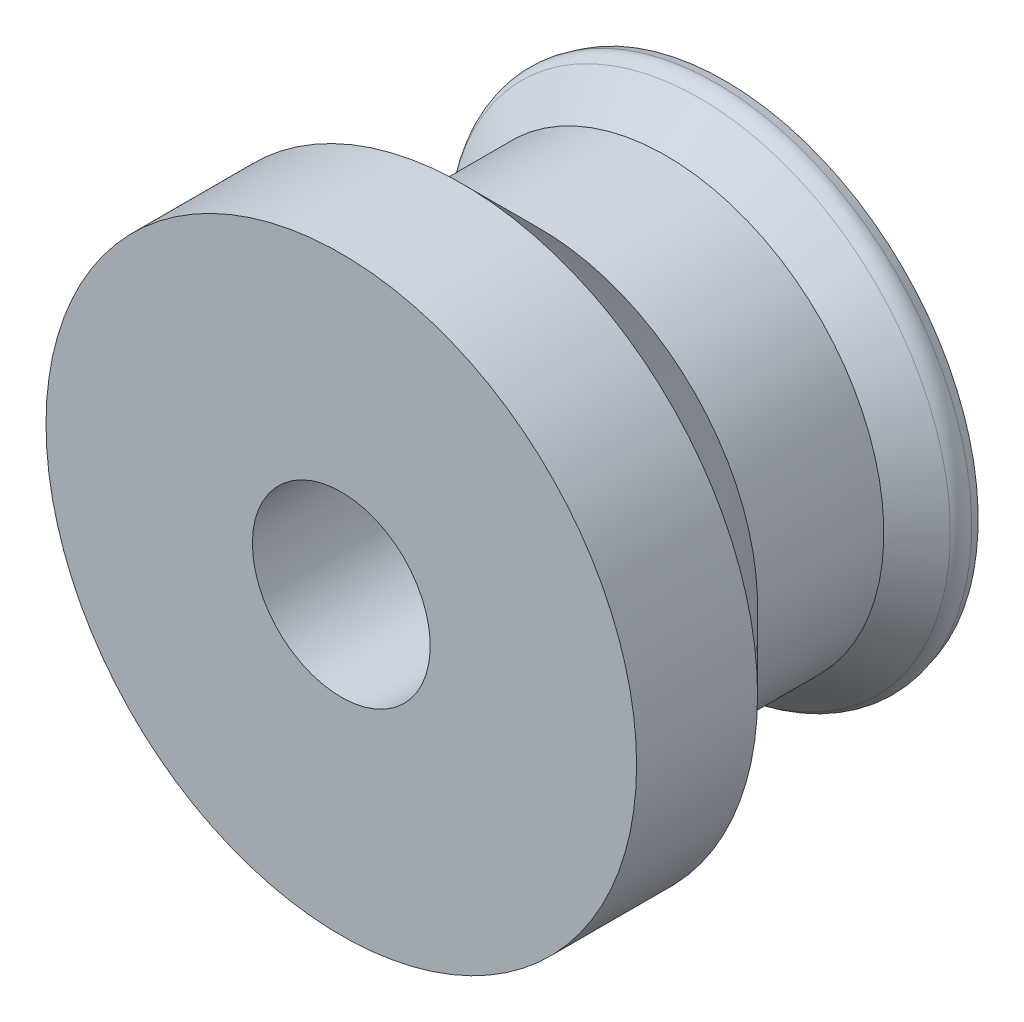
ISO-10303-21;
HEADER;
FILE_DESCRIPTION(('STEP AP214'),'2;1');
FILE_NAME('part.step','',(''),(''),'','','');
FILE_SCHEMA(('AUTOMOTIVE_DESIGN { 1 0 10303 214 1 1 1 1 }'));
ENDSEC;
DATA;
#1=APPLICATION_CONTEXT('core data for automotive mechanical design processes');
#2=APPLICATION_PROTOCOL_DEFINITION('international standard','automotive_design',2000,#1);
#3=PRODUCT_CONTEXT('',#1,'mechanical');
#4=PRODUCT('Part','Part','',(#3));
#5=PRODUCT_RELATED_PRODUCT_CATEGORY('part','',(#4));
#6=PRODUCT_DEFINITION_FORMATION('','',#4);
#7=PRODUCT_DEFINITION_CONTEXT('part definition',#1,'design');
#8=PRODUCT_DEFINITION('design','',#6,#7);
#9=PRODUCT_DEFINITION_SHAPE('','',#8);
#10=(LENGTH_UNIT() NAMED_UNIT(*) SI_UNIT(.MILLI.,.METRE.));
#11=(NAMED_UNIT(*) PLANE_ANGLE_UNIT() SI_UNIT($,.RADIAN.));
#12=(NAMED_UNIT(*) SI_UNIT($,.STERADIAN.) SOLID_ANGLE_UNIT());
#13=UNCERTAINTY_MEASURE_WITH_UNIT(LENGTH_MEASURE(1.E-05),#10,'distance_accuracy_value','');
#14=(GEOMETRIC_REPRESENTATION_CONTEXT(3) GLOBAL_UNCERTAINTY_ASSIGNED_CONTEXT((#13)) GLOBAL_UNIT_ASSIGNED_CONTEXT((#10,
#11,#12)) REPRESENTATION_CONTEXT('',''));
#15=CARTESIAN_POINT('',(0.,0.,0.));
#16=DIRECTION('',(0.,0.,1.));
#17=DIRECTION('',(1.,0.,0.));
#18=AXIS2_PLACEMENT_3D('',#15,#16,#17);
#19=CARTESIAN_POINT('',(106.300627663817,-64.3207708541283,11.));
#20=DIRECTION('',(0.,0.,-1.));
#21=DIRECTION('',(-1.,0.,0.));
#22=AXIS2_PLACEMENT_3D('',#19,#20,#21);
#23=CYLINDRICAL_SURFACE('',#22,8.46966991411011);
#24=CARTESIAN_POINT('',(106.300627663817,-64.3207708541283,11.));
#25=DIRECTION('',(0.,0.,-1.));
#26=DIRECTION('',(-1.,0.,0.));
#27=AXIS2_PLACEMENT_3D('',#24,#25,#26);
#28=CIRCLE('',#27,8.46966991411011);
#29=CARTESIAN_POINT('',(97.8309577497071,-64.3207708541283,11.));
#30=VERTEX_POINT('',#29);
#31=EDGE_CURVE('E10',#30,#30,#28,.T.);
#32=ORIENTED_EDGE('',*,*,#31,.T.);
#33=EDGE_LOOP('',(#32));
#34=FACE_BOUND('',#33,.T.);
#35=CARTESIAN_POINT('',(106.300627663817,-64.3207708541283,7.53033008588991));
#36=DIRECTION('',(0.,0.,-1.));
#37=DIRECTION('',(-1.,0.,0.));
#38=AXIS2_PLACEMENT_3D('',#35,#36,#37);
#39=CIRCLE('',#38,8.46966991411011);
#40=CARTESIAN_POINT('',(97.8309577497071,-64.3207708541283,7.53033008588991));
#41=VERTEX_POINT('',#40);
#42=EDGE_CURVE('E55',#41,#41,#39,.T.);
#43=ORIENTED_EDGE('',*,*,#42,.F.);
#44=EDGE_LOOP('',(#43));
#45=FACE_BOUND('',#44,.T.);
#46=ADVANCED_FACE('F30',(#34,#45),#23,.T.);
#47=CARTESIAN_POINT('',(114.770297577927,-64.3207708541283,11.));
#48=DIRECTION('',(0.,0.,1.));
#49=DIRECTION('',(1.,0.,0.));
#50=AXIS2_PLACEMENT_3D('',#47,#48,#49);
#51=PLANE('',#50);
#52=CARTESIAN_POINT('',(106.300627663817,-64.3207708541283,11.));
#53=DIRECTION('',(0.,0.,-1.));
#54=DIRECTION('',(-1.,0.,0.));
#55=AXIS2_PLACEMENT_3D('',#52,#53,#54);
#56=CIRCLE('',#55,2.54999999999998);
#57=CARTESIAN_POINT('',(103.750627663817,-64.3207708541283,11.));
#58=VERTEX_POINT('',#57);
#59=EDGE_CURVE('E58',#58,#58,#56,.T.);
#60=ORIENTED_EDGE('',*,*,#59,.T.);
#61=EDGE_LOOP('',(#60));
#62=FACE_BOUND('',#61,.T.);
#63=ORIENTED_EDGE('',*,*,#31,.F.);
#64=EDGE_LOOP('',(#63));
#65=FACE_BOUND('',#64,.T.);
#66=ADVANCED_FACE('F70',(#62,#65),#51,.T.);
#67=CARTESIAN_POINT('',(106.300627663817,-64.3207708541283,0.));
#68=DIRECTION('',(0.,0.,-1.));
#69=DIRECTION('',(-1.,0.,0.));
#70=AXIS2_PLACEMENT_3D('',#67,#68,#69);
#71=PLANE('',#70);
#72=CARTESIAN_POINT('',(106.300627663817,-64.3207708541283,0.));
#73=DIRECTION('',(0.,0.,-1.));
#74=DIRECTION('',(-1.,0.,0.));
#75=AXIS2_PLACEMENT_3D('',#72,#73,#74);
#76=CIRCLE('',#75,2.54999999999998);
#77=CARTESIAN_POINT('',(103.750627663817,-64.3207708541283,0.));
#78=VERTEX_POINT('',#77);
#79=EDGE_CURVE('E61',#78,#78,#76,.T.);
#80=ORIENTED_EDGE('',*,*,#79,.F.);
#81=EDGE_LOOP('',(#80));
#82=FACE_BOUND('',#81,.T.);
#83=CARTESIAN_POINT('',(106.300627663817,-64.3207708541283,0.));
#84=DIRECTION('',(0.,0.,-1.));
#85=DIRECTION('',(-1.,0.,0.));
#86=AXIS2_PLACEMENT_3D('',#83,#84,#85);
#87=CIRCLE('',#86,7.26690822409418);
#88=CARTESIAN_POINT('',(99.033719439723,-64.3207708541283,0.));
#89=VERTEX_POINT('',#88);
#90=EDGE_CURVE('E36',#89,#89,#87,.T.);
#91=ORIENTED_EDGE('',*,*,#90,.T.);
#92=EDGE_LOOP('',(#91));
#93=FACE_BOUND('',#92,.T.);
#94=ADVANCED_FACE('F67',(#82,#93),#71,.T.);
#95=CARTESIAN_POINT('',(106.300627663817,-64.3207708541283,0.));
#96=DIRECTION('',(0.,0.,1.));
#97=DIRECTION('',(1.,0.,0.));
#98=AXIS2_PLACEMENT_3D('',#95,#96,#97);
#99=CONICAL_SURFACE('',#98,7.26690822409418,0.261799387799164);
#100=CARTESIAN_POINT('',(106.300627663817,-64.3207708541283,0.251491317977325));
#101=DIRECTION('',(0.,0.,-1.));
#102=DIRECTION('',(-1.,0.,0.));
#103=AXIS2_PLACEMENT_3D('',#100,#101,#102);
#104=CIRCLE('',#103,7.33429511964964);
#105=CARTESIAN_POINT('',(98.9663325441676,-64.3207708541283,0.251491317977325));
#106=VERTEX_POINT('',#105);
#107=EDGE_CURVE('E40',#106,#106,#104,.T.);
#108=ORIENTED_EDGE('',*,*,#107,.T.);
#109=EDGE_LOOP('',(#108));
#110=FACE_BOUND('',#109,.T.);
#111=ORIENTED_EDGE('',*,*,#90,.F.);
#112=EDGE_LOOP('',(#111));
#113=FACE_BOUND('',#112,.T.);
#114=ADVANCED_FACE('F69',(#110,#113),#99,.T.);
#115=CARTESIAN_POINT('',(106.300627663817,-64.3207708541283,0.380900840528578));
#116=DIRECTION('',(0.,0.,-1.));
#117=DIRECTION('',(-1.,0.,0.));
#118=AXIS2_PLACEMENT_3D('',#115,#116,#117);
#119=TOROIDAL_SURFACE('',#118,6.85133220650511,0.499999999999974);
#120=CARTESIAN_POINT('',(106.300627663817,-64.3207708541283,0.734454231121869));
#121=DIRECTION('',(0.,0.,-1.));
#122=DIRECTION('',(-1.,0.,0.));
#123=AXIS2_PLACEMENT_3D('',#120,#121,#122);
#124=CIRCLE('',#123,7.20488559709832);
#125=CARTESIAN_POINT('',(99.0957420667189,-64.3207708541283,0.734454231121869));
#126=VERTEX_POINT('',#125);
#127=EDGE_CURVE('E44',#126,#126,#124,.T.);
#128=ORIENTED_EDGE('',*,*,#127,.T.);
#129=EDGE_LOOP('',(#128));
#130=FACE_BOUND('',#129,.T.);
#131=ORIENTED_EDGE('',*,*,#107,.F.);
#132=EDGE_LOOP('',(#131));
#133=FACE_BOUND('',#132,.T.);
#134=ADVANCED_FACE('F76',(#130,#133),#119,.T.);
#135=CARTESIAN_POINT('',(106.300627663817,-64.3207708541283,0.734454231121869));
#136=DIRECTION('',(0.,0.,-1.));
#137=DIRECTION('',(-1.,0.,0.));
#138=AXIS2_PLACEMENT_3D('',#135,#136,#137);
#139=CONICAL_SURFACE('',#138,7.20488559709832,0.785398163397467);
#140=CARTESIAN_POINT('',(106.300627663817,-64.3207708541283,1.68933982822015));
#141=DIRECTION('',(0.,0.,-1.));
#142=DIRECTION('',(-1.,0.,0.));
#143=AXIS2_PLACEMENT_3D('',#140,#141,#142);
#144=CIRCLE('',#143,6.25000000000001);
#145=CARTESIAN_POINT('',(100.050627663817,-64.3207708541283,1.68933982822015));
#146=VERTEX_POINT('',#145);
#147=EDGE_CURVE('E49',#146,#146,#144,.T.);
#148=ORIENTED_EDGE('',*,*,#147,.T.);
#149=EDGE_LOOP('',(#148));
#150=FACE_BOUND('',#149,.T.);
#151=ORIENTED_EDGE('',*,*,#127,.F.);
#152=EDGE_LOOP('',(#151));
#153=FACE_BOUND('',#152,.T.);
#154=ADVANCED_FACE('F95',(#150,#153),#139,.T.);
#155=CARTESIAN_POINT('',(106.300627663817,-64.3207708541283,11.));
#156=DIRECTION('',(0.,0.,-1.));
#157=DIRECTION('',(-1.,0.,0.));
#158=AXIS2_PLACEMENT_3D('',#155,#156,#157);
#159=CYLINDRICAL_SURFACE('',#158,6.25000000000003);
#160=CARTESIAN_POINT('',(106.300627663817,-64.3207708541283,5.31066017177982));
#161=DIRECTION('',(0.,0.,-1.));
#162=DIRECTION('',(-1.,0.,0.));
#163=AXIS2_PLACEMENT_3D('',#160,#161,#162);
#164=CIRCLE('',#163,6.25000000000005);
#165=CARTESIAN_POINT('',(100.050627663817,-64.3207708541283,5.31066017177982));
#166=VERTEX_POINT('',#165);
#167=EDGE_CURVE('E52',#166,#166,#164,.T.);
#168=ORIENTED_EDGE('',*,*,#167,.T.);
#169=EDGE_LOOP('',(#168));
#170=FACE_BOUND('',#169,.T.);
#171=ORIENTED_EDGE('',*,*,#147,.F.);
#172=EDGE_LOOP('',(#171));
#173=FACE_BOUND('',#172,.T.);
#174=ADVANCED_FACE('F89',(#170,#173),#159,.T.);
#175=CARTESIAN_POINT('',(106.300627663817,-64.3207708541283,5.31066017177982));
#176=DIRECTION('',(0.,0.,1.));
#177=DIRECTION('',(1.,0.,0.));
#178=AXIS2_PLACEMENT_3D('',#175,#176,#177);
#179=CONICAL_SURFACE('',#178,6.25000000000005,0.785398163397441);
#180=ORIENTED_EDGE('',*,*,#42,.T.);
#181=EDGE_LOOP('',(#180));
#182=FACE_BOUND('',#181,.T.);
#183=ORIENTED_EDGE('',*,*,#167,.F.);
#184=EDGE_LOOP('',(#183));
#185=FACE_BOUND('',#184,.T.);
#186=ADVANCED_FACE('F86',(#182,#185),#179,.T.);
#187=CARTESIAN_POINT('',(106.300627663817,-64.3207708541283,0.));
#188=DIRECTION('',(0.,0.,-1.));
#189=DIRECTION('',(-1.,0.,0.));
#190=AXIS2_PLACEMENT_3D('',#187,#188,#189);
#191=CYLINDRICAL_SURFACE('',#190,2.54999999999998);
#192=ORIENTED_EDGE('',*,*,#59,.F.);
#193=EDGE_LOOP('',(#192));
#194=FACE_BOUND('',#193,.T.);
#195=ORIENTED_EDGE('',*,*,#79,.T.);
#196=EDGE_LOOP('',(#195));
#197=FACE_BOUND('',#196,.T.);
#198=ADVANCED_FACE('F65',(#194,#197),#191,.F.);
#199=CLOSED_SHELL('',(#46,#66,#94,#114,#134,#154,#174,#186,#198));
#200=MANIFOLD_SOLID_BREP('B2',#199);
#201=ADVANCED_BREP_SHAPE_REPRESENTATION('',(#18,#200),#14);
#202=SHAPE_DEFINITION_REPRESENTATION(#9,#201);
ENDSEC;
END-ISO-10303-21;
